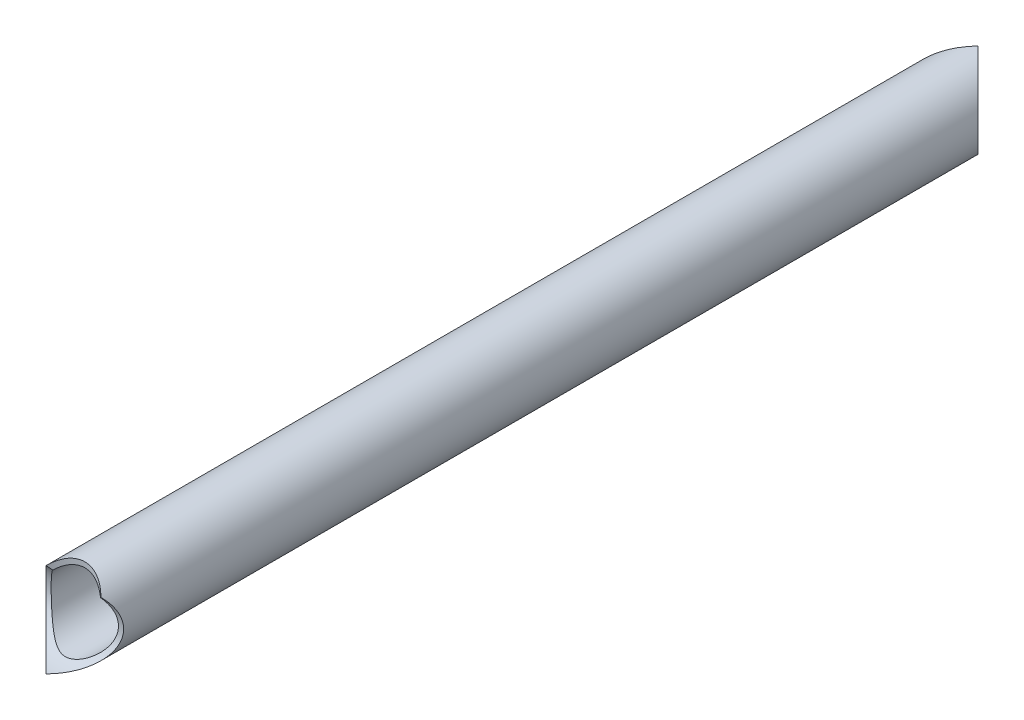
ISO-10303-21;
HEADER;
FILE_DESCRIPTION(('STEP AP214'),'2;1');
FILE_NAME('part.step','',(''),(''),'','','');
FILE_SCHEMA(('AUTOMOTIVE_DESIGN { 1 0 10303 214 1 1 1 1 }'));
ENDSEC;
DATA;
#1=APPLICATION_CONTEXT('core data for automotive mechanical design processes');
#2=APPLICATION_PROTOCOL_DEFINITION('international standard','automotive_design',2000,#1);
#3=PRODUCT_CONTEXT('',#1,'mechanical');
#4=PRODUCT('Part','Part','',(#3));
#5=PRODUCT_RELATED_PRODUCT_CATEGORY('part','',(#4));
#6=PRODUCT_DEFINITION_FORMATION('','',#4);
#7=PRODUCT_DEFINITION_CONTEXT('part definition',#1,'design');
#8=PRODUCT_DEFINITION('design','',#6,#7);
#9=PRODUCT_DEFINITION_SHAPE('','',#8);
#10=(LENGTH_UNIT() NAMED_UNIT(*) SI_UNIT(.MILLI.,.METRE.));
#11=(NAMED_UNIT(*) PLANE_ANGLE_UNIT() SI_UNIT($,.RADIAN.));
#12=(NAMED_UNIT(*) SI_UNIT($,.STERADIAN.) SOLID_ANGLE_UNIT());
#13=UNCERTAINTY_MEASURE_WITH_UNIT(LENGTH_MEASURE(1.E-05),#10,'distance_accuracy_value','');
#14=(GEOMETRIC_REPRESENTATION_CONTEXT(3) GLOBAL_UNCERTAINTY_ASSIGNED_CONTEXT((#13)) GLOBAL_UNIT_ASSIGNED_CONTEXT((#10,
#11,#12)) REPRESENTATION_CONTEXT('',''));
#15=CARTESIAN_POINT('',(0.,0.,0.));
#16=DIRECTION('',(0.,0.,1.));
#17=DIRECTION('',(1.,0.,0.));
#18=AXIS2_PLACEMENT_3D('',#15,#16,#17);
#19=CARTESIAN_POINT('',(-161.925,-228.6,0.));
#20=DIRECTION('',(1.,0.,0.));
#21=DIRECTION('',(0.,0.,-1.));
#22=AXIS2_PLACEMENT_3D('',#19,#20,#21);
#23=CYLINDRICAL_SURFACE('',#22,9.52499999999998);
#24=CARTESIAN_POINT('',(0.,-228.6,0.));
#25=DIRECTION('',(0.707106781186547,0.,-0.707106781186547));
#26=DIRECTION('',(-0.707106781186547,0.,-0.707106781186547));
#27=AXIS2_PLACEMENT_3D('',#24,#25,#26);
#28=ELLIPSE('',#27,13.4703841816037,9.52499999999999);
#29=CARTESIAN_POINT('',(0.,-219.075,0.));
#30=VERTEX_POINT('',#29);
#31=CARTESIAN_POINT('',(0.,-238.125,0.));
#32=VERTEX_POINT('',#31);
#33=EDGE_CURVE('E88',#30,#32,#28,.T.);
#34=ORIENTED_EDGE('',*,*,#33,.T.);
#35=CARTESIAN_POINT('',(0.,-228.6,0.));
#36=DIRECTION('',(-0.707106781186547,0.,-0.707106781186547));
#37=DIRECTION('',(0.707106781186547,0.,-0.707106781186547));
#38=AXIS2_PLACEMENT_3D('',#35,#36,#37);
#39=ELLIPSE('',#38,13.4703841816037,9.52499999999999);
#40=EDGE_CURVE('E85',#32,#30,#39,.T.);
#41=ORIENTED_EDGE('',*,*,#40,.T.);
#42=EDGE_LOOP('',(#34,#41));
#43=FACE_BOUND('',#42,.T.);
#44=CARTESIAN_POINT('',(8.255,-228.6,9.52499999999998));
#45=CARTESIAN_POINT('',(8.2549991309736,-228.793749133983,9.52499914862957));
#46=CARTESIAN_POINT('',(8.24816678082066,-228.987510695369,9.51907602387494));
#47=CARTESIAN_POINT('',(8.22096978778912,-229.373368577547,9.49551993069773));
#48=CARTESIAN_POINT('',(8.20060395213658,-229.565464750048,9.47788593013703));
#49=CARTESIAN_POINT('',(8.14671669800962,-229.946505754108,9.43129946891753));
#50=CARTESIAN_POINT('',(8.11318830370018,-230.135448859172,9.4023410066018));
#51=CARTESIAN_POINT('',(8.03357968300137,-230.508674190852,9.33373426055012));
#52=CARTESIAN_POINT('',(7.98749944772571,-230.692956414168,9.29408596924612));
#53=CARTESIAN_POINT('',(7.883876820132,-231.054517254249,9.20518387045815));
#54=CARTESIAN_POINT('',(7.82641012090953,-231.231833318214,9.15599353806628));
#55=CARTESIAN_POINT('',(7.70062697305924,-231.579870442183,9.04871137350904));
#56=CARTESIAN_POINT('',(7.6323057787879,-231.75058857676,8.99061564825053));
#57=CARTESIAN_POINT('',(7.48568628536983,-232.084651882336,8.86648613376938));
#58=CARTESIAN_POINT('',(7.40738906925855,-232.247997851083,8.80045320628405));
#59=CARTESIAN_POINT('',(7.24162523096907,-232.566887574014,8.66139148346517));
#60=CARTESIAN_POINT('',(7.15415660082003,-232.722429608553,8.58836115643807));
#61=CARTESIAN_POINT('',(6.93563606350435,-233.083524955091,8.40705776916898));
#62=CARTESIAN_POINT('',(6.80073731523925,-233.285372428281,8.29601262769738));
#63=CARTESIAN_POINT('',(6.51661799509542,-233.673118621409,8.064743848003));
#64=CARTESIAN_POINT('',(6.36739233738682,-233.859011633082,7.94451695352174));
#65=CARTESIAN_POINT('',(6.05568545559861,-234.215142976407,7.69694275303349));
#66=CARTESIAN_POINT('',(5.89317377902937,-234.385343327033,7.5695793122203));
#67=CARTESIAN_POINT('',(5.55624676339447,-234.709650125725,7.31032763517801));
#68=CARTESIAN_POINT('',(5.38183301047553,-234.863758711384,7.17844000303206));
#69=CARTESIAN_POINT('',(5.01788704155426,-235.159109417956,6.90973126096916));
#70=CARTESIAN_POINT('',(4.82811425764205,-235.300013389537,6.77286471020443));
#71=CARTESIAN_POINT('',(4.43682954916935,-235.565304618899,6.49972297017358));
#72=CARTESIAN_POINT('',(4.2353138496898,-235.689686522828,6.36344798637051));
#73=CARTESIAN_POINT('',(3.82063329870353,-235.921483300549,6.09531136489422));
#74=CARTESIAN_POINT('',(3.60749309828613,-236.028932333052,5.96344127621438));
#75=CARTESIAN_POINT('',(3.1684318197033,-236.226529850752,5.70855763052586));
#76=CARTESIAN_POINT('',(2.94252102945845,-236.316692012068,5.58553712092024));
#77=CARTESIAN_POINT('',(2.46681442998312,-236.482003581481,5.34987442057175));
#78=CARTESIAN_POINT('',(2.21641466916655,-236.556366663297,5.23788214298109));
#79=CARTESIAN_POINT('',(1.6996389172864,-236.682480743163,5.04111943195068));
#80=CARTESIAN_POINT('',(1.43329846759246,-236.734280059203,4.95629093434715));
#81=CARTESIAN_POINT('',(1.04394084534303,-236.789573262637,4.86390243338427));
#82=CARTESIAN_POINT('',(0.926240140688825,-236.803739392844,4.83991842714096));
#83=CARTESIAN_POINT('',(0.68899088744703,-236.827058784652,4.80017344286401));
#84=CARTESIAN_POINT('',(0.569443240153932,-236.836214416545,4.78440857680626));
#85=CARTESIAN_POINT('',(0.329320339337278,-236.849304199387,4.76180407323095));
#86=CARTESIAN_POINT('',(0.208746073071892,-236.853242897697,4.7549566628614));
#87=CARTESIAN_POINT('',(-0.0326338460710329,-236.855817780715,4.75048470187363));
#88=CARTESIAN_POINT('',(-0.153439501382275,-236.854453909342,4.75286024879902));
#89=CARTESIAN_POINT('',(-0.394165546022864,-236.846462088077,4.76671281142097));
#90=CARTESIAN_POINT('',(-0.514086996622046,-236.839842089721,4.77817607905766));
#91=CARTESIAN_POINT('',(-0.752426471254606,-236.821507905245,4.80965247391349));
#92=CARTESIAN_POINT('',(-0.870843834060238,-236.809791553356,4.82966923600077));
#93=CARTESIAN_POINT('',(-1.22310602414194,-236.767308180379,4.90141020066702));
#94=CARTESIAN_POINT('',(-1.45376292887394,-236.72921400914,4.96481146964588));
#95=CARTESIAN_POINT('',(-1.86370727584937,-236.644099327065,5.10130504482216));
#96=CARTESIAN_POINT('',(-2.04487996617531,-236.59983803945,5.17071608363488));
#97=CARTESIAN_POINT('',(-2.39953345699069,-236.500705639612,5.32095731682433));
#98=CARTESIAN_POINT('',(-2.57300885110593,-236.445827210796,5.40179537549808));
#99=CARTESIAN_POINT('',(-2.91302040075868,-236.32605718343,5.571759952105));
#100=CARTESIAN_POINT('',(-3.07953040069091,-236.261131514579,5.66091424590639));
#101=CARTESIAN_POINT('',(-3.40543837179348,-236.121927466596,5.84461572787491));
#102=CARTESIAN_POINT('',(-3.56483714546792,-236.047650146436,5.93916230476356));
#103=CARTESIAN_POINT('',(-3.95950975045322,-235.848366005193,6.18246639561214));
#104=CARTESIAN_POINT('',(-4.19036061822685,-235.717295478695,6.33346592764874));
#105=CARTESIAN_POINT('',(-4.63747538270596,-235.434385836415,6.63777489853464));
#106=CARTESIAN_POINT('',(-4.8537319131979,-235.282536348192,6.79108545677496));
#107=CARTESIAN_POINT('',(-5.27132385376008,-234.958297438884,7.09556835836753));
#108=CARTESIAN_POINT('',(-5.47267772045492,-234.785934138232,7.24674315239448));
#109=CARTESIAN_POINT('',(-5.85993838639321,-234.420393868889,7.54347617660768));
#110=CARTESIAN_POINT('',(-6.04585204532014,-234.227226231587,7.68903688542422));
#111=CARTESIAN_POINT('',(-6.3582089363936,-233.86880872899,7.93730120225216));
#112=CARTESIAN_POINT('',(-6.48822041734569,-233.707976401375,8.04190982332083));
#113=CARTESIAN_POINT('',(-6.73756594349468,-233.374263989522,8.24439807207292));
#114=CARTESIAN_POINT('',(-6.85690232909824,-233.201386560908,8.34227917360146));
#115=CARTESIAN_POINT('',(-7.08366003651119,-232.843997602673,8.5296406653929));
#116=CARTESIAN_POINT('',(-7.19109566852851,-232.659500473618,8.61913112474723));
#117=CARTESIAN_POINT('',(-7.39290924178347,-232.279162252312,8.78821213101052));
#118=CARTESIAN_POINT('',(-7.48728961825413,-232.083323285382,8.86780452395283));
#119=CARTESIAN_POINT('',(-7.6460745272022,-231.716896785423,9.00231134156524));
#120=CARTESIAN_POINT('',(-7.71282515872359,-231.548010254905,9.05909739341585));
#121=CARTESIAN_POINT('',(-7.83572387058534,-231.203811346086,9.16395879695114));
#122=CARTESIAN_POINT('',(-7.8918741654245,-231.028500319075,9.21203596790858));
#123=CARTESIAN_POINT('',(-7.99277926561639,-230.672375751217,9.29862621941024));
#124=CARTESIAN_POINT('',(-8.03753797954923,-230.491564121593,9.33714258026413));
#125=CARTESIAN_POINT('',(-8.11497986008864,-230.125491254042,9.40388814271988));
#126=CARTESIAN_POINT('',(-8.14766289484145,-229.940229967554,9.43211723199548));
#127=CARTESIAN_POINT('',(-8.20051181828126,-229.565693777288,9.47780652362298));
#128=CARTESIAN_POINT('',(-8.22061737363726,-229.376403964305,9.49521481683602));
#129=CARTESIAN_POINT('',(-8.24768993736896,-228.99618049332,9.51866289629087));
#130=CARTESIAN_POINT('',(-8.25465691616095,-228.805246831616,9.52470265693454));
#131=CARTESIAN_POINT('',(-8.2553183095402,-228.423354685229,9.52527587201023));
#132=CARTESIAN_POINT('',(-8.24901373573472,-228.232396203547,9.51981020342901));
#133=CARTESIAN_POINT('',(-8.22325492565545,-227.852047815249,9.49749861914187));
#134=CARTESIAN_POINT('',(-8.20380124943698,-227.662657842174,9.48065318813039));
#135=CARTESIAN_POINT('',(-8.15408122776019,-227.301276987326,9.43766380719512));
#136=CARTESIAN_POINT('',(-8.12475103759837,-227.129059372116,9.41232559052557));
#137=CARTESIAN_POINT('',(-8.05561104968292,-226.788261428203,9.35270884257684));
#138=CARTESIAN_POINT('',(-8.01579775061751,-226.619682335142,9.31842732431001));
#139=CARTESIAN_POINT('',(-7.92625943872893,-226.287193793368,9.24151845756409));
#140=CARTESIAN_POINT('',(-7.87653736329024,-226.123282977198,9.19889358247868));
#141=CARTESIAN_POINT('',(-7.76777500026873,-225.800772493091,9.10593936756861));
#142=CARTESIAN_POINT('',(-7.70873123855651,-225.642174832152,9.05560715548276));
#143=CARTESIAN_POINT('',(-7.57702515132393,-225.318760887249,8.94374675295488));
#144=CARTESIAN_POINT('',(-7.50365911320598,-225.154427355192,8.88165097638803));
#145=CARTESIAN_POINT('',(-7.34765599089065,-224.833184711284,8.75025080214965));
#146=CARTESIAN_POINT('',(-7.26501525757015,-224.676278556494,8.68094356792161));
#147=CARTESIAN_POINT('',(-7.00428589271634,-224.217216319907,8.4635302513619));
#148=CARTESIAN_POINT('',(-6.81336884998674,-223.926665178198,8.3059143565942));
#149=CARTESIAN_POINT('',(-6.45283278047182,-223.445068693598,8.01320461595647));
#150=CARTESIAN_POINT('',(-6.28928934942977,-223.24698711938,7.88192799380305));
#151=CARTESIAN_POINT('',(-5.94739409173004,-222.869526138686,7.61190373485768));
#152=CARTESIAN_POINT('',(-5.76904131931234,-222.690147928305,7.47315562111757));
#153=CARTESIAN_POINT('',(-5.3982783866759,-222.349627109202,7.19079436686113));
#154=CARTESIAN_POINT('',(-5.20583488153899,-222.188530218004,7.04717014783934));
#155=CARTESIAN_POINT('',(-4.8078844024781,-221.884949827782,6.75851614265832));
#156=CARTESIAN_POINT('',(-4.60238145150821,-221.742460637592,6.6134868009023));
#157=CARTESIAN_POINT('',(-4.22170022153728,-221.503388496548,6.35515925689206));
#158=CARTESIAN_POINT('',(-4.04894034477486,-221.403382572897,6.24145035992447));
#159=CARTESIAN_POINT('',(-3.69470620817147,-221.215258160118,6.01768753522882));
#160=CARTESIAN_POINT('',(-3.51323035552951,-221.127141855052,5.90763428181514));
#161=CARTESIAN_POINT('',(-3.14146809775944,-220.963421066369,5.69440913102353));
#162=CARTESIAN_POINT('',(-2.95120539019991,-220.887785187886,5.59122036896019));
#163=CARTESIAN_POINT('',(-2.56091153040393,-220.749545792574,5.39540026708191));
#164=CARTESIAN_POINT('',(-2.36088739974969,-220.686933073675,5.30276149380793));
#165=CARTESIAN_POINT('',(-1.9171010961857,-220.566906121685,5.11946097161139));
#166=CARTESIAN_POINT('',(-1.67147843973416,-220.511947549068,5.03151344556329));
#167=CARTESIAN_POINT('',(-1.29366079541495,-220.445995162006,4.92337591366429));
#168=CARTESIAN_POINT('',(-1.16625357807994,-220.426766608547,4.89130870864686));
#169=CARTESIAN_POINT('',(-0.908760812182196,-220.394148700816,4.83638807525039));
#170=CARTESIAN_POINT('',(-0.7786767431181,-220.380756207151,4.81352969366662));
#171=CARTESIAN_POINT('',(-0.515053294315988,-220.360010368661,4.77793189105998));
#172=CARTESIAN_POINT('',(-0.381491235325661,-220.35273047777,4.76531560533637));
#173=CARTESIAN_POINT('',(-0.11358208005872,-220.344693892553,4.75138012581384));
#174=CARTESIAN_POINT('',(0.0207649568470339,-220.34393671112,4.75006008842704));
#175=CARTESIAN_POINT('',(0.289034938598481,-220.348970145875,4.75879767507651));
#176=CARTESIAN_POINT('',(0.422957602740178,-220.354764441386,4.76886169242107));
#177=CARTESIAN_POINT('',(0.689111683742144,-220.372731137426,4.79979015185108));
#178=CARTESIAN_POINT('',(0.821342817729425,-220.384904590814,4.82065637679737));
#179=CARTESIAN_POINT('',(1.10454643006355,-220.417793404478,4.8763024194385));
#180=CARTESIAN_POINT('',(1.25505528789718,-220.439578635414,4.91279727603143));
#181=CARTESIAN_POINT('',(1.55170325268704,-220.490749992828,4.99680884433466));
#182=CARTESIAN_POINT('',(1.69783869586883,-220.520142303591,5.04433452044916));
#183=CARTESIAN_POINT('',(1.98570912314554,-220.586021121705,5.1483552274228));
#184=CARTESIAN_POINT('',(2.12742964309166,-220.622528578341,5.20487665227988));
#185=CARTESIAN_POINT('',(2.4059581107911,-220.702066057463,5.32479592263946));
#186=CARTESIAN_POINT('',(2.542767153659,-220.745094614622,5.38819222241237));
#187=CARTESIAN_POINT('',(2.90759118568054,-220.870168950102,5.56725013397185));
#188=CARTESIAN_POINT('',(3.13110425848443,-220.958163433105,5.68795470478581));
#189=CARTESIAN_POINT('',(3.56559758605923,-221.150968983281,5.93823193042161));
#190=CARTESIAN_POINT('',(3.77656911147845,-221.255791579878,6.06781063001076));
#191=CARTESIAN_POINT('',(4.18706965610037,-221.481824189893,6.3314612221958));
#192=CARTESIAN_POINT('',(4.38658228698,-221.603056880467,6.46553913594521));
#193=CARTESIAN_POINT('',(4.77419601105204,-221.861578509005,6.7345464325855));
#194=CARTESIAN_POINT('',(4.96229989336762,-221.998863498402,6.86947559839097));
#195=CARTESIAN_POINT('',(5.33822587447611,-222.298444095809,7.14562965260793));
#196=CARTESIAN_POINT('',(5.52532860119197,-222.461755311956,7.28673552413446));
#197=CARTESIAN_POINT('',(5.88601693765022,-222.806719513531,7.5638943285916));
#198=CARTESIAN_POINT('',(6.05959990411036,-222.988376069838,7.69994627070965));
#199=CARTESIAN_POINT('',(6.39160103031025,-223.369682424321,7.96385928877272));
#200=CARTESIAN_POINT('',(6.55005185964251,-223.569291566071,8.09173780370973));
#201=CARTESIAN_POINT('',(6.85042540907247,-223.98667872514,8.33674937621355));
#202=CARTESIAN_POINT('',(6.99235568599345,-224.204448356632,8.45388734147135));
#203=CARTESIAN_POINT('',(7.21895608703126,-224.591711433497,8.64240803344506));
#204=CARTESIAN_POINT('',(7.30828007272977,-224.756843154747,8.71719498210351));
#205=CARTESIAN_POINT('',(7.47660654907035,-225.095556720758,8.85879069211981));
#206=CARTESIAN_POINT('',(7.55561158090455,-225.269136470562,8.92560141738874));
#207=CARTESIAN_POINT('',(7.70228991439694,-225.623998853516,9.05010324269441));
#208=CARTESIAN_POINT('',(7.76997311226876,-225.805274584102,9.107802304579));
#209=CARTESIAN_POINT('',(7.89311833522139,-226.174795693031,9.2130828730719));
#210=CARTESIAN_POINT('',(7.94858170019485,-226.363040304597,9.26066548891849));
#211=CARTESIAN_POINT('',(8.039551741935,-226.718653766488,9.33887209356159));
#212=CARTESIAN_POINT('',(8.07676302214277,-226.885271665007,9.37093582182723));
#213=CARTESIAN_POINT('',(8.14097036810243,-227.221958753979,9.42633196678231));
#214=CARTESIAN_POINT('',(8.16796357789891,-227.392028895362,9.44966194236372));
#215=CARTESIAN_POINT('',(8.21131805296772,-227.734511854833,9.48716109489849));
#216=CARTESIAN_POINT('',(8.22768016098987,-227.906924486121,9.50133099798964));
#217=CARTESIAN_POINT('',(8.24951956226246,-228.252888376113,9.52024913405288));
#218=CARTESIAN_POINT('',(8.2550007784753,-228.426439201805,9.52500076265902));
#219=CARTESIAN_POINT('',(8.255,-228.6,9.52499999999998));
#220=B_SPLINE_CURVE_WITH_KNOTS('',3,(#44,#45,#46,#47,#48,#49,#50,#51,#52,#53,#54,#55,#56,#57,
#58,#59,#60,#61,#62,#63,#64,#65,#66,#67,#68,#69,#70,#71,#72,#73,#74,#75,#76,#77,#78,#79,#80,#81,
#82,#83,#84,#85,#86,#87,#88,#89,#90,#91,#92,#93,#94,#95,#96,#97,#98,#99,#100,#101,#102,#103,
#104,#105,#106,#107,#108,#109,#110,#111,#112,#113,#114,#115,#116,#117,#118,#119,#120,#121,#122,
#123,#124,#125,#126,#127,#128,#129,#130,#131,#132,#133,#134,#135,#136,#137,#138,#139,#140,#141,
#142,#143,#144,#145,#146,#147,#148,#149,#150,#151,#152,#153,#154,#155,#156,#157,#158,#159,#160,
#161,#162,#163,#164,#165,#166,#167,#168,#169,#170,#171,#172,#173,#174,#175,#176,#177,#178,#179,
#180,#181,#182,#183,#184,#185,#186,#187,#188,#189,#190,#191,#192,#193,#194,#195,#196,#197,#198,
#199,#200,#201,#202,#203,#204,#205,#206,#207,#208,#209,#210,#211,#212,#213,#214,#215,#216,#217,
#218,#219),.UNSPECIFIED.,.T.,.F.,(4,2,2,2,2,2,2,2,2,2,2,2,2,2,2,2,2,2,2,2,2,2,2,2,2,2,2,2,2,2,2,
2,2,2,2,2,2,2,2,2,2,2,2,2,2,2,2,2,2,2,2,2,2,2,2,2,2,2,2,2,2,2,2,2,2,2,2,2,2,2,2,2,2,2,2,2,2,2,2,
2,2,2,2,2,2,2,2,4),(0.,0.581060302241148,1.16217182303355,1.74359173542285,2.3250120594397,
2.90268969124201,3.48062058537875,4.05848879048121,4.63648377810276,5.43621695420251,
6.23623508026262,7.03814127970887,7.83994081992868,8.65857780584581,9.47747942119572,
10.2947073130676,11.1112859813718,11.9620431912298,12.8109695269324,13.1734956172864,
13.5358500604877,13.8978884475344,14.2599306635729,14.6214262186982,14.9830755469358,
15.7069631447091,16.3031815010826,16.8998122025499,17.4985123074859,18.0971446771323,
19.0121600805803,19.927633918925,20.8419543021521,21.7558662790184,22.4505614625091,
23.1451039659047,23.8388020282264,24.5323705181271,25.102627506706,25.6727652316906,
26.2427070714556,26.8126551342036,27.3853166471829,27.9579794496038,28.5305986031097,
29.1031933687764,29.6321866176357,30.1613567724987,30.6903702914557,31.2195814376324,
31.7901536941553,32.360951234249,33.5023725912857,34.3667872613036,35.2312571774337,
36.097843397763,36.9641639487798,37.6529096955542,38.341781789667,39.0288936791848,
39.715518398605,40.512573766315,40.9105237639805,41.3082594272077,41.7107088469782,
42.1131282121322,42.5157736890733,42.918485642225,43.38692566356,43.8557477127695,
44.32597156752,44.7960899166667,45.6013224389748,46.4071090223581,47.2140207141776,
48.0207343366109,48.8767355197429,49.732903643882,50.5871794481831,51.441062941544,
52.0468024868874,52.6523925776822,53.2574505352097,53.8624421156741,54.3830405578493,
54.9037844002805,55.4244869572119,55.9450017475653),.UNSPECIFIED.);
#221=CARTESIAN_POINT('',(8.255,-228.6,9.52499999999998));
#222=VERTEX_POINT('',#221);
#223=EDGE_CURVE('E82',#222,#222,#220,.T.);
#224=ORIENTED_EDGE('',*,*,#223,.F.);
#225=EDGE_LOOP('',(#224));
#226=FACE_BOUND('',#225,.T.);
#227=ADVANCED_FACE('F33',(#43,#226),#23,.F.);
#228=CARTESIAN_POINT('',(0.,-219.075,228.6));
#229=DIRECTION('',(0.,-1.,0.));
#230=DIRECTION('',(0.,0.,-1.));
#231=AXIS2_PLACEMENT_3D('',#228,#229,#230);
#232=CYLINDRICAL_SURFACE('',#231,9.52499999999999);
#233=CARTESIAN_POINT('',(0.,-228.6,228.6));
#234=DIRECTION('',(0.707106781186547,-0.707106781186547,0.));
#235=DIRECTION('',(-0.707106781186547,-0.707106781186547,0.));
#236=AXIS2_PLACEMENT_3D('',#233,#234,#235);
#237=ELLIPSE('',#236,13.4703841816037,9.52499999999999);
#238=CARTESIAN_POINT('',(6.73519209080185,-221.864807909198,221.864807909198));
#239=VERTEX_POINT('',#238);
#240=CARTESIAN_POINT('',(5.837166478695,-222.762833521305,221.073173809633));
#241=VERTEX_POINT('',#240);
#242=EDGE_CURVE('E47',#239,#241,#237,.F.);
#243=ORIENTED_EDGE('',*,*,#242,.F.);
#244=CARTESIAN_POINT('',(0.,-228.6,228.6));
#245=DIRECTION('',(0.,-0.707106781186547,-0.707106781186548));
#246=DIRECTION('',(0.,0.707106781186548,-0.707106781186547));
#247=AXIS2_PLACEMENT_3D('',#244,#245,#246);
#248=ELLIPSE('',#247,13.4703841816037,9.525);
#249=CARTESIAN_POINT('',(-6.73519209080185,-221.864807909198,221.864807909198));
#250=VERTEX_POINT('',#249);
#251=EDGE_CURVE('E84',#250,#239,#248,.T.);
#252=ORIENTED_EDGE('',*,*,#251,.F.);
#253=CARTESIAN_POINT('',(0.,-228.6,228.6));
#254=DIRECTION('',(-0.707106781186547,-0.707106781186547,0.));
#255=DIRECTION('',(0.707106781186547,-0.707106781186547,0.));
#256=AXIS2_PLACEMENT_3D('',#253,#254,#255);
#257=ELLIPSE('',#256,13.4703841816037,9.52499999999999);
#258=CARTESIAN_POINT('',(-5.83716647869502,-222.762833521305,221.073173809633));
#259=VERTEX_POINT('',#258);
#260=EDGE_CURVE('E11',#259,#250,#257,.F.);
#261=ORIENTED_EDGE('',*,*,#260,.F.);
#262=CARTESIAN_POINT('',(0.,-220.345,219.075));
#263=CARTESIAN_POINT('',(0.193749133982708,-220.345000869026,219.07500085137));
#264=CARTESIAN_POINT('',(0.387510695368548,-220.351833219179,219.080923976125));
#265=CARTESIAN_POINT('',(0.773368577546698,-220.379030212211,219.104480069302));
#266=CARTESIAN_POINT('',(0.965464750048039,-220.399396047863,219.122114069863));
#267=CARTESIAN_POINT('',(1.34650575410772,-220.45328330199,219.168700531082));
#268=CARTESIAN_POINT('',(1.53544885917174,-220.4868116963,219.197658993398));
#269=CARTESIAN_POINT('',(1.90867419085192,-220.566420316999,219.26626573945));
#270=CARTESIAN_POINT('',(2.09295641416823,-220.612500552274,219.305914030754));
#271=CARTESIAN_POINT('',(2.45451725424898,-220.716123179868,219.394816129542));
#272=CARTESIAN_POINT('',(2.63183331821417,-220.773589879091,219.444006461934));
#273=CARTESIAN_POINT('',(2.97987044218349,-220.899373026941,219.551288626491));
#274=CARTESIAN_POINT('',(3.15058857675983,-220.967694221212,219.609384351749));
#275=CARTESIAN_POINT('',(3.48465188233568,-221.11431371463,219.733513866231));
#276=CARTESIAN_POINT('',(3.64799785108297,-221.192610930741,219.799546793716));
#277=CARTESIAN_POINT('',(3.9668875740142,-221.358374769031,219.938608516535));
#278=CARTESIAN_POINT('',(4.12242960855343,-221.44584339918,220.011638843562));
#279=CARTESIAN_POINT('',(4.48352495509109,-221.664363936496,220.192942230831));
#280=CARTESIAN_POINT('',(4.68537242828056,-221.799262684761,220.303987372303));
#281=CARTESIAN_POINT('',(5.07311862140913,-222.083382004905,220.535256151997));
#282=CARTESIAN_POINT('',(5.25901163308176,-222.232607662613,220.655483046478));
#283=CARTESIAN_POINT('',(5.61514297640732,-222.544314544401,220.903057246966));
#284=CARTESIAN_POINT('',(5.78534332703317,-222.706826220971,221.03042068778));
#285=CARTESIAN_POINT('',(6.1096501257253,-223.043753236606,221.289672364822));
#286=CARTESIAN_POINT('',(6.26375871138407,-223.218166989525,221.421559996968));
#287=CARTESIAN_POINT('',(6.55910941795629,-223.582112958446,221.690268739031));
#288=CARTESIAN_POINT('',(6.70001338953653,-223.771885742358,221.827135289795));
#289=CARTESIAN_POINT('',(6.96530461889882,-224.163170450831,222.100277029826));
#290=CARTESIAN_POINT('',(7.08968652282802,-224.36468615031,222.236552013629));
#291=CARTESIAN_POINT('',(7.32148330054927,-224.779366701297,222.504688635106));
#292=CARTESIAN_POINT('',(7.42893233305184,-224.992506901714,222.636558723786));
#293=CARTESIAN_POINT('',(7.62652985075221,-225.431568180297,222.891442369474));
#294=CARTESIAN_POINT('',(7.71669201206843,-225.657478970542,223.01446287908));
#295=CARTESIAN_POINT('',(7.88200358148074,-226.133185570017,223.250125579428));
#296=CARTESIAN_POINT('',(7.95636666329744,-226.383585330833,223.362117857019));
#297=CARTESIAN_POINT('',(8.08248074316303,-226.900361082714,223.558880568049));
#298=CARTESIAN_POINT('',(8.1342800592027,-227.166701532408,223.643709065653));
#299=CARTESIAN_POINT('',(8.18957326263654,-227.556059154657,223.736097566616));
#300=CARTESIAN_POINT('',(8.20373939284397,-227.673759859311,223.760081572859));
#301=CARTESIAN_POINT('',(8.22705878465155,-227.911009112553,223.799826557136));
#302=CARTESIAN_POINT('',(8.23621441654546,-228.030556759846,223.815591423194));
#303=CARTESIAN_POINT('',(8.2493041993867,-228.270679660663,223.838195926769));
#304=CARTESIAN_POINT('',(8.25324289769712,-228.391253926928,223.845043337138));
#305=CARTESIAN_POINT('',(8.25581778071506,-228.632633846071,223.849515298126));
#306=CARTESIAN_POINT('',(8.25445390934166,-228.753439501382,223.847139751201));
#307=CARTESIAN_POINT('',(8.24646208807654,-228.994165546023,223.833287188579));
#308=CARTESIAN_POINT('',(8.2398420897209,-229.114086996622,223.821823920942));
#309=CARTESIAN_POINT('',(8.22150790524539,-229.352426471255,223.790347526086));
#310=CARTESIAN_POINT('',(8.20979155335593,-229.47084383406,223.770330763999));
#311=CARTESIAN_POINT('',(8.16730818037862,-229.823106024142,223.698589799333));
#312=CARTESIAN_POINT('',(8.12921400914041,-230.053762928874,223.635188530354));
#313=CARTESIAN_POINT('',(8.04409932706535,-230.463707275849,223.498694955178));
#314=CARTESIAN_POINT('',(7.99983803945024,-230.644879966175,223.429283916365));
#315=CARTESIAN_POINT('',(7.90070563961175,-230.999533456991,223.279042683176));
#316=CARTESIAN_POINT('',(7.84582721079585,-231.173008851106,223.198204624502));
#317=CARTESIAN_POINT('',(7.72605718342993,-231.513020400759,223.028240047895));
#318=CARTESIAN_POINT('',(7.66113151457856,-231.679530400691,222.939085754094));
#319=CARTESIAN_POINT('',(7.52192746659583,-232.005438371794,222.755384272125));
#320=CARTESIAN_POINT('',(7.44765014643552,-232.164837145468,222.660837695236));
#321=CARTESIAN_POINT('',(7.24836600519316,-232.559509750453,222.417533604388));
#322=CARTESIAN_POINT('',(7.11729547869541,-232.790360618227,222.266534072351));
#323=CARTESIAN_POINT('',(6.83438583641456,-233.237475382706,221.962225101465));
#324=CARTESIAN_POINT('',(6.68253634819235,-233.453731913198,221.808914543225));
#325=CARTESIAN_POINT('',(6.35829743888427,-233.87132385376,221.504431641632));
#326=CARTESIAN_POINT('',(6.18593413823202,-234.072677720455,221.353256847605));
#327=CARTESIAN_POINT('',(5.82039386888942,-234.459938386393,221.056523823392));
#328=CARTESIAN_POINT('',(5.62722623158674,-234.64585204532,220.910963114576));
#329=CARTESIAN_POINT('',(5.26880872898991,-234.958208936394,220.662698797748));
#330=CARTESIAN_POINT('',(5.10797640137497,-235.088220417346,220.558090176679));
#331=CARTESIAN_POINT('',(4.77426398952177,-235.337565943495,220.355601927927));
#332=CARTESIAN_POINT('',(4.60138656090798,-235.456902329098,220.257720826398));
#333=CARTESIAN_POINT('',(4.24399760267341,-235.683660036511,220.070359334607));
#334=CARTESIAN_POINT('',(4.05950047361767,-235.791095668529,219.980868875253));
#335=CARTESIAN_POINT('',(3.67916225231211,-235.992909241784,219.811787868989));
#336=CARTESIAN_POINT('',(3.48332328538176,-236.087289618254,219.732195476047));
#337=CARTESIAN_POINT('',(3.11689678542335,-236.246074527202,219.597688658435));
#338=CARTESIAN_POINT('',(2.94801025490547,-236.312825158724,219.540902606584));
#339=CARTESIAN_POINT('',(2.60381134608641,-236.435723870585,219.436041203049));
#340=CARTESIAN_POINT('',(2.42850031907459,-236.491874165425,219.387964032091));
#341=CARTESIAN_POINT('',(2.0723757512167,-236.592779265616,219.30137378059));
#342=CARTESIAN_POINT('',(1.89156412159269,-236.637537979549,219.262857419736));
#343=CARTESIAN_POINT('',(1.52549125404211,-236.714979860089,219.19611185728));
#344=CARTESIAN_POINT('',(1.34022996755348,-236.747662894841,219.167882768004));
#345=CARTESIAN_POINT('',(0.965693777288019,-236.800511818281,219.122193476377));
#346=CARTESIAN_POINT('',(0.776403964305411,-236.820617373637,219.104785183164));
#347=CARTESIAN_POINT('',(0.396180493319812,-236.847689937369,219.081337103709));
#348=CARTESIAN_POINT('',(0.205246831616394,-236.854656916161,219.075297343065));
#349=CARTESIAN_POINT('',(-0.176645314770568,-236.85531830954,219.07472412799));
#350=CARTESIAN_POINT('',(-0.367603796452825,-236.849013735735,219.080189796571));
#351=CARTESIAN_POINT('',(-0.747952184751143,-236.823254925655,219.102501380858));
#352=CARTESIAN_POINT('',(-0.937342157826406,-236.803801249437,219.11934681187));
#353=CARTESIAN_POINT('',(-1.29872301267435,-236.75408122776,219.162336192805));
#354=CARTESIAN_POINT('',(-1.47094062788416,-236.724751037598,219.187674409474));
#355=CARTESIAN_POINT('',(-1.81173857179723,-236.655611049683,219.247291157423));
#356=CARTESIAN_POINT('',(-1.98031766485832,-236.615797750618,219.28157267569));
#357=CARTESIAN_POINT('',(-2.31280620663191,-236.526259438729,219.358481542436));
#358=CARTESIAN_POINT('',(-2.47671702280222,-236.47653736329,219.401106417521));
#359=CARTESIAN_POINT('',(-2.79922750690905,-236.367775000269,219.494060632431));
#360=CARTESIAN_POINT('',(-2.95782516784805,-236.308731238557,219.544392844517));
#361=CARTESIAN_POINT('',(-3.28123911275146,-236.177025151324,219.656253247045));
#362=CARTESIAN_POINT('',(-3.4455726448075,-236.103659113206,219.718349023612));
#363=CARTESIAN_POINT('',(-3.76681528871589,-235.947655990891,219.84974919785));
#364=CARTESIAN_POINT('',(-3.92372144350641,-235.86501525757,219.919056432078));
#365=CARTESIAN_POINT('',(-4.38278368009278,-235.604285892716,220.136469748638));
#366=CARTESIAN_POINT('',(-4.67333482180182,-235.413368849987,220.294085643406));
#367=CARTESIAN_POINT('',(-5.1549313064018,-235.052832780472,220.586795384043));
#368=CARTESIAN_POINT('',(-5.35301288062008,-234.88928934943,220.718072006197));
#369=CARTESIAN_POINT('',(-5.73047386131385,-234.54739409173,220.988096265142));
#370=CARTESIAN_POINT('',(-5.90985207169504,-234.369041319312,221.126844378882));
#371=CARTESIAN_POINT('',(-6.25037289079781,-233.998278386676,221.409205633139));
#372=CARTESIAN_POINT('',(-6.41146978199638,-233.805834881539,221.552829852161));
#373=CARTESIAN_POINT('',(-6.7150501722183,-233.407884402478,221.841483857342));
#374=CARTESIAN_POINT('',(-6.85753936240803,-233.202381451508,221.986513199098));
#375=CARTESIAN_POINT('',(-7.09661150345158,-232.821700221537,222.244840743108));
#376=CARTESIAN_POINT('',(-7.19661742710287,-232.648940344775,222.358549640075));
#377=CARTESIAN_POINT('',(-7.38474183988216,-232.294706208171,222.582312464771));
#378=CARTESIAN_POINT('',(-7.47285814494784,-232.11323035553,222.692365718185));
#379=CARTESIAN_POINT('',(-7.63657893363065,-231.741468097759,222.905590868976));
#380=CARTESIAN_POINT('',(-7.71221481211429,-231.5512053902,223.00877963104));
#381=CARTESIAN_POINT('',(-7.8504542074264,-231.160911530404,223.204599732918));
#382=CARTESIAN_POINT('',(-7.9130669263247,-230.96088739975,223.297238506192));
#383=CARTESIAN_POINT('',(-8.03309387831453,-230.517101096186,223.480539028389));
#384=CARTESIAN_POINT('',(-8.08805245093232,-230.271478439734,223.568486554437));
#385=CARTESIAN_POINT('',(-8.15400483799359,-229.893660795415,223.676624086336));
#386=CARTESIAN_POINT('',(-8.17323339145289,-229.76625357808,223.708691291353));
#387=CARTESIAN_POINT('',(-8.20585129918378,-229.508760812182,223.76361192475));
#388=CARTESIAN_POINT('',(-8.21924379284914,-229.378676743118,223.786470306333));
#389=CARTESIAN_POINT('',(-8.23998963133893,-229.115053294316,223.82206810894));
#390=CARTESIAN_POINT('',(-8.24726952222987,-228.981491235326,223.834684394664));
#391=CARTESIAN_POINT('',(-8.25530610744689,-228.713582080059,223.848619874186));
#392=CARTESIAN_POINT('',(-8.25606328887974,-228.579235043153,223.849939911573));
#393=CARTESIAN_POINT('',(-8.25102985412451,-228.310965061402,223.841202324923));
#394=CARTESIAN_POINT('',(-8.24523555861444,-228.17704239726,223.831138307579));
#395=CARTESIAN_POINT('',(-8.2272688625743,-227.910888316258,223.800209848149));
#396=CARTESIAN_POINT('',(-8.21509540918585,-227.778657182271,223.779343623203));
#397=CARTESIAN_POINT('',(-8.18220659552174,-227.495453569936,223.723697580561));
#398=CARTESIAN_POINT('',(-8.16042136458583,-227.344944712103,223.687202723968));
#399=CARTESIAN_POINT('',(-8.10925000717226,-227.048296747313,223.603191155665));
#400=CARTESIAN_POINT('',(-8.07985769640949,-226.902161304131,223.555665479551));
#401=CARTESIAN_POINT('',(-8.01397887829545,-226.614290876854,223.451644772577));
#402=CARTESIAN_POINT('',(-7.97747142165907,-226.472570356908,223.39512334772));
#403=CARTESIAN_POINT('',(-7.8979339425372,-226.194041889209,223.27520407736));
#404=CARTESIAN_POINT('',(-7.8549053853782,-226.057232846341,223.211807777587));
#405=CARTESIAN_POINT('',(-7.72983104989829,-225.692408814319,223.032749866028));
#406=CARTESIAN_POINT('',(-7.64183656689504,-225.468895741516,222.912045295214));
#407=CARTESIAN_POINT('',(-7.4490310167194,-225.034402413941,222.661768069578));
#408=CARTESIAN_POINT('',(-7.34420842012193,-224.823430888522,222.532189369989));
#409=CARTESIAN_POINT('',(-7.11817581010648,-224.4129303439,222.268538777804));
#410=CARTESIAN_POINT('',(-6.99694311953327,-224.21341771302,222.134460864055));
#411=CARTESIAN_POINT('',(-6.73842149099524,-223.825803988948,221.865453567414));
#412=CARTESIAN_POINT('',(-6.60113650159798,-223.637700106632,221.730524401609));
#413=CARTESIAN_POINT('',(-6.30155590419081,-223.261774125524,221.454370347392));
#414=CARTESIAN_POINT('',(-6.13824468804442,-223.074671398808,221.313264475865));
#415=CARTESIAN_POINT('',(-5.79328048646943,-222.71398306235,221.036105671408));
#416=CARTESIAN_POINT('',(-5.61162393016209,-222.54040009589,220.90005372929));
#417=CARTESIAN_POINT('',(-5.23031757567867,-222.20839896969,220.636140711227));
#418=CARTESIAN_POINT('',(-5.03070843392945,-222.049948140358,220.50826219629));
#419=CARTESIAN_POINT('',(-4.61332127485986,-221.749574590928,220.263250623786));
#420=CARTESIAN_POINT('',(-4.39555164336823,-221.607644314007,220.146112658529));
#421=CARTESIAN_POINT('',(-4.00828856650278,-221.381043912969,219.957591966555));
#422=CARTESIAN_POINT('',(-3.84315684525286,-221.29171992727,219.882805017896));
#423=CARTESIAN_POINT('',(-3.50444327924167,-221.12339345093,219.74120930788));
#424=CARTESIAN_POINT('',(-3.33086352943793,-221.044388419095,219.674398582611));
#425=CARTESIAN_POINT('',(-2.97600114648418,-220.897710085603,219.549896757306));
#426=CARTESIAN_POINT('',(-2.79472541589764,-220.830026887731,219.492197695421));
#427=CARTESIAN_POINT('',(-2.42520430696857,-220.706881664779,219.386917126928));
#428=CARTESIAN_POINT('',(-2.23695969540343,-220.651418299805,219.339334511081));
#429=CARTESIAN_POINT('',(-1.88134623351221,-220.560448258065,219.261127906438));
#430=CARTESIAN_POINT('',(-1.71472833499286,-220.523236977857,219.229064178173));
#431=CARTESIAN_POINT('',(-1.37804124602052,-220.459029631898,219.173668033218));
#432=CARTESIAN_POINT('',(-1.20797110463795,-220.432036422101,219.150338057636));
#433=CARTESIAN_POINT('',(-0.865488145166974,-220.388681947032,219.112838905101));
#434=CARTESIAN_POINT('',(-0.693075513879146,-220.37231983901,219.09866900201));
#435=CARTESIAN_POINT('',(-0.347111623887307,-220.350480437738,219.079750865947));
#436=CARTESIAN_POINT('',(-0.173560798194561,-220.344999221525,219.074999237341));
#437=CARTESIAN_POINT('',(0.,-220.345,219.075));
#438=B_SPLINE_CURVE_WITH_KNOTS('',3,(#262,#263,#264,#265,#266,#267,#268,#269,#270,#271,#272,
#273,#274,#275,#276,#277,#278,#279,#280,#281,#282,#283,#284,#285,#286,#287,#288,#289,#290,#291,
#292,#293,#294,#295,#296,#297,#298,#299,#300,#301,#302,#303,#304,#305,#306,#307,#308,#309,#310,
#311,#312,#313,#314,#315,#316,#317,#318,#319,#320,#321,#322,#323,#324,#325,#326,#327,#328,#329,
#330,#331,#332,#333,#334,#335,#336,#337,#338,#339,#340,#341,#342,#343,#344,#345,#346,#347,#348,
#349,#350,#351,#352,#353,#354,#355,#356,#357,#358,#359,#360,#361,#362,#363,#364,#365,#366,#367,
#368,#369,#370,#371,#372,#373,#374,#375,#376,#377,#378,#379,#380,#381,#382,#383,#384,#385,#386,
#387,#388,#389,#390,#391,#392,#393,#394,#395,#396,#397,#398,#399,#400,#401,#402,#403,#404,#405,
#406,#407,#408,#409,#410,#411,#412,#413,#414,#415,#416,#417,#418,#419,#420,#421,#422,#423,#424,
#425,#426,#427,#428,#429,#430,#431,#432,#433,#434,#435,#436,#437),.UNSPECIFIED.,.T.,.F.,(4,2,2,
2,2,2,2,2,2,2,2,2,2,2,2,2,2,2,2,2,2,2,2,2,2,2,2,2,2,2,2,2,2,2,2,2,2,2,2,2,2,2,2,2,2,2,2,2,2,2,2,
2,2,2,2,2,2,2,2,2,2,2,2,2,2,2,2,2,2,2,2,2,2,2,2,2,2,2,2,2,2,2,2,2,2,2,2,4),(0.,
0.581060302241168,1.16217182303357,1.74359173542286,2.32501205943971,2.90268969124202,
3.48062058537873,4.05848879048122,4.63648377810278,5.43621695420252,6.23623508026263,
7.03814127970889,7.8399408199287,8.65857780584584,9.47747942119576,10.2947073130676,
11.1112859813718,11.9620431912297,12.8109695269324,13.1734956172863,13.5358500604876,
13.8978884475343,14.2599306635728,14.6214262186981,14.9830755469357,15.706963144709,
16.3031815010825,16.8998122025499,17.4985123074859,18.0971446771323,19.0121600805803,
19.9276339189251,20.8419543021521,21.7558662790184,22.4505614625091,23.1451039659047,
23.8388020282264,24.5323705181272,25.102627506706,25.6727652316906,26.2427070714557,
26.8126551342036,27.3853166471829,27.9579794496038,28.5305986031097,29.1031933687764,
29.6321866176357,30.1613567724987,30.6903702914557,31.2195814376324,31.7901536941553,
32.360951234249,33.5023725912857,34.3667872613036,35.2312571774338,36.097843397763,
36.9641639487798,37.6529096955542,38.3417817896671,39.0288936791849,39.715518398605,
40.512573766315,40.9105237639805,41.3082594272077,41.7107088469781,42.1131282121322,
42.5157736890733,42.918485642225,43.38692566356,43.8557477127695,44.32597156752,
44.7960899166667,45.6013224389748,46.4071090223582,47.2140207141777,48.020734336611,
48.8767355197429,49.732903643882,50.5871794481831,51.4410629415441,52.0468024868875,
52.6523925776822,53.2574505352097,53.8624421156741,54.3830405578493,54.9037844002805,
55.4244869572119,55.9450017475653),.UNSPECIFIED.);
#439=EDGE_CURVE('E80',#259,#241,#438,.T.);
#440=ORIENTED_EDGE('',*,*,#439,.T.);
#441=EDGE_LOOP('',(#243,#252,#261,#440));
#442=FACE_BOUND('',#441,.T.);
#443=ADVANCED_FACE('F83',(#442),#232,.F.);
#444=CARTESIAN_POINT('',(0.,-228.6,228.6));
#445=DIRECTION('',(0.,0.,-1.));
#446=DIRECTION('',(0.,1.,0.));
#447=AXIS2_PLACEMENT_3D('',#444,#445,#446);
#448=CYLINDRICAL_SURFACE('',#447,9.525);
#449=CARTESIAN_POINT('',(0.,-228.6,228.6));
#450=DIRECTION('',(0.707106781186547,0.,-0.707106781186547));
#451=DIRECTION('',(-0.707106781186547,0.,-0.707106781186547));
#452=AXIS2_PLACEMENT_3D('',#449,#450,#451);
#453=ELLIPSE('',#452,13.4703841816037,9.525);
#454=CARTESIAN_POINT('',(0.,-238.125,228.6));
#455=VERTEX_POINT('',#454);
#456=EDGE_CURVE('E81',#250,#455,#453,.F.);
#457=ORIENTED_EDGE('',*,*,#456,.F.);
#458=ORIENTED_EDGE('',*,*,#251,.T.);
#459=CARTESIAN_POINT('',(0.,-228.6,228.6));
#460=DIRECTION('',(-0.707106781186547,0.,-0.707106781186547));
#461=DIRECTION('',(0.707106781186547,0.,-0.707106781186547));
#462=AXIS2_PLACEMENT_3D('',#459,#460,#461);
#463=ELLIPSE('',#462,13.4703841816037,9.525);
#464=EDGE_CURVE('E71',#455,#239,#463,.F.);
#465=ORIENTED_EDGE('',*,*,#464,.F.);
#466=EDGE_LOOP('',(#457,#458,#465));
#467=FACE_BOUND('',#466,.T.);
#468=ORIENTED_EDGE('',*,*,#33,.F.);
#469=ORIENTED_EDGE('',*,*,#40,.F.);
#470=EDGE_LOOP('',(#468,#469));
#471=FACE_BOUND('',#470,.T.);
#472=ADVANCED_FACE('F103',(#467,#471),#448,.T.);
#473=CARTESIAN_POINT('',(0.,-228.6,228.6));
#474=DIRECTION('',(0.,0.,-1.));
#475=DIRECTION('',(0.,1.,0.));
#476=AXIS2_PLACEMENT_3D('',#473,#474,#475);
#477=CYLINDRICAL_SURFACE('',#476,8.255);
#478=ORIENTED_EDGE('',*,*,#223,.T.);
#479=EDGE_LOOP('',(#478));
#480=FACE_BOUND('',#479,.T.);
#481=ORIENTED_EDGE('',*,*,#439,.F.);
#482=CARTESIAN_POINT('',(0.,-220.345,223.848095118797));
#483=CARTESIAN_POINT('',(-0.135655546148849,-220.344996321841,223.848105333112));
#484=CARTESIAN_POINT('',(-0.271277656091385,-220.348351012075,223.842260499928));
#485=CARTESIAN_POINT('',(-0.541272953064596,-220.361656219574,223.819257519012));
#486=CARTESIAN_POINT('',(-0.675645742214575,-220.371608769751,223.802095884391));
#487=CARTESIAN_POINT('',(-0.942295424086365,-220.397859694978,223.757357791509));
#488=CARTESIAN_POINT('',(-1.07456695404325,-220.414172220086,223.72975811419));
#489=CARTESIAN_POINT('',(-1.33601736063069,-220.452757545791,223.665481983676));
#490=CARTESIAN_POINT('',(-1.46519489061247,-220.475032892102,223.628801654171));
#491=CARTESIAN_POINT('',(-1.77500336273896,-220.535947517145,223.530353919286));
#492=CARTESIAN_POINT('',(-1.95379062427453,-220.577500622833,223.464590374509));
#493=CARTESIAN_POINT('',(-2.30385769496949,-220.670931089417,223.321478130963));
#494=CARTESIAN_POINT('',(-2.47513319304754,-220.722814286644,223.244122889214));
#495=CARTESIAN_POINT('',(-2.81092641284362,-220.836288228685,223.080913848368));
#496=CARTESIAN_POINT('',(-2.97542141871818,-220.897908713207,222.995034323331));
#497=CARTESIAN_POINT('',(-3.29749611909182,-221.030201895937,222.817608896567));
#498=CARTESIAN_POINT('',(-3.45507632677546,-221.100873920851,222.726063416561));
#499=CARTESIAN_POINT('',(-3.84973065266654,-221.292739997934,222.487368178982));
#500=CARTESIAN_POINT('',(-4.08223351978583,-221.420160561037,222.337629545601));
#501=CARTESIAN_POINT('',(-4.53266062865202,-221.695674614923,222.035102572798));
#502=CARTESIAN_POINT('',(-4.75057725789492,-221.84377877786,221.882312694121));
#503=CARTESIAN_POINT('',(-5.17166746250181,-222.160420381687,221.57820623111));
#504=CARTESIAN_POINT('',(-5.37485644128694,-222.328935966915,221.426888255098));
#505=CARTESIAN_POINT('',(-5.76604719603185,-222.686632729974,221.129268880716));
#506=CARTESIAN_POINT('',(-5.95405552024644,-222.875804913741,220.98296533519));
#507=CARTESIAN_POINT('',(-6.27277775679104,-223.229675234222,220.731001954068));
#508=CARTESIAN_POINT('',(-6.40681293092104,-223.390188375653,220.623651829533));
#509=CARTESIAN_POINT('',(-6.66411124136181,-223.723630915661,220.415548106164));
#510=CARTESIAN_POINT('',(-6.78737668101028,-223.896557644844,220.314793097986));
#511=CARTESIAN_POINT('',(-7.02188056667099,-224.254436092272,220.121615827485));
#512=CARTESIAN_POINT('',(-7.13313403611314,-224.43937231523,220.029183180964));
#513=CARTESIAN_POINT('',(-7.34245719653476,-224.821020737572,219.854202209525));
#514=CARTESIAN_POINT('',(-7.44052949635537,-225.017730595523,219.771651929026));
#515=CARTESIAN_POINT('',(-7.60530072806874,-225.384861277747,219.632300032369));
#516=CARTESIAN_POINT('',(-7.67445084553776,-225.553448006738,219.573556639931));
#517=CARTESIAN_POINT('',(-7.80217351121648,-225.897273905864,219.464717079769));
#518=CARTESIAN_POINT('',(-7.86074832215371,-226.072511643193,219.414619062355));
#519=CARTESIAN_POINT('',(-7.96650342740497,-226.428743622432,219.323953638185));
#520=CARTESIAN_POINT('',(-8.01368763408823,-226.609735863581,219.283382959173));
#521=CARTESIAN_POINT('',(-8.09594954704615,-226.976444842074,219.212531655335));
#522=CARTESIAN_POINT('',(-8.13102711878627,-227.162161631895,219.182251144857));
#523=CARTESIAN_POINT('',(-8.18861481606975,-227.537960769509,219.132487065259));
#524=CARTESIAN_POINT('',(-8.21105991631436,-227.728060554779,219.113059364422));
#525=CARTESIAN_POINT('',(-8.24268538027252,-228.110188471271,219.085673986089));
#526=CARTESIAN_POINT('',(-8.25186571465046,-228.302216606757,219.07771633396));
#527=CARTESIAN_POINT('',(-8.25678295988299,-228.686551431868,219.073454802843));
#528=CARTESIAN_POINT('',(-8.25252146294257,-228.878858085804,219.077149543612));
#529=CARTESIAN_POINT('',(-8.23064110316092,-229.262126409139,219.096104854982));
#530=CARTESIAN_POINT('',(-8.21302289201324,-229.453088143701,219.111364861298));
#531=CARTESIAN_POINT('',(-8.16674035275837,-229.816621266078,219.15139556382));
#532=CARTESIAN_POINT('',(-8.13909510869822,-229.989421400574,219.175288225491));
#533=CARTESIAN_POINT('',(-8.07323648254331,-230.331540691296,219.232104301772));
#534=CARTESIAN_POINT('',(-8.03501957945297,-230.500858667534,219.265030725136));
#535=CARTESIAN_POINT('',(-7.94857055230143,-230.834954010066,219.339336629045));
#536=CARTESIAN_POINT('',(-7.90034136789663,-230.999732693071,219.380713628401));
#537=CARTESIAN_POINT('',(-7.79445518111057,-231.324080466533,219.471288150669));
#538=CARTESIAN_POINT('',(-7.73679465286544,-231.483647581803,219.520488598147));
#539=CARTESIAN_POINT('',(-7.6082548767218,-231.80812552021,219.629776245678));
#540=CARTESIAN_POINT('',(-7.53672479468674,-231.972601014281,219.690390688015));
#541=CARTESIAN_POINT('',(-7.38437847020362,-232.29427788547,219.818885114032));
#542=CARTESIAN_POINT('',(-7.30355858178033,-232.451476372392,219.886767949621));
#543=CARTESIAN_POINT('',(-7.04827147225395,-232.911595440243,220.100005471802));
#544=CARTESIAN_POINT('',(-6.86094783286652,-233.203111514566,220.254974015158));
#545=CARTESIAN_POINT('',(-6.50691398502622,-233.686429690587,220.543157260558));
#546=CARTESIAN_POINT('',(-6.34631867413865,-233.885211060989,220.672459722882));
#547=CARTESIAN_POINT('',(-6.01036138557726,-234.264334952376,220.938764119418));
#548=CARTESIAN_POINT('',(-5.83499841949564,-234.444676237362,221.075766568789));
#549=CARTESIAN_POINT('',(-5.47027813063148,-234.787398510239,221.354951874508));
#550=CARTESIAN_POINT('',(-5.28088562014702,-234.949731599831,221.49714726962));
#551=CARTESIAN_POINT('',(-4.88917788911999,-235.256032823039,221.783348722516));
#552=CARTESIAN_POINT('',(-4.68686634512345,-235.400006146897,221.927354255878));
#553=CARTESIAN_POINT('',(-4.30579135660818,-235.646079841737,222.188702233621));
#554=CARTESIAN_POINT('',(-4.12908749329795,-235.751101541252,222.30630822594));
#555=CARTESIAN_POINT('',(-3.76648616004439,-235.948554202829,222.538025733349));
#556=CARTESIAN_POINT('',(-3.58058670193474,-236.040982425712,222.652136484024));
#557=CARTESIAN_POINT('',(-3.19951034180239,-236.212601348476,222.873442083891));
#558=CARTESIAN_POINT('',(-3.00435940697979,-236.291826573714,222.980654505907));
#559=CARTESIAN_POINT('',(-2.60374189216029,-236.436512029484,223.184255995461));
#560=CARTESIAN_POINT('',(-2.39828334928052,-236.501982784285,223.280653311695));
#561=CARTESIAN_POINT('',(-1.9488792680523,-236.625447525122,223.468526253393));
#562=CARTESIAN_POINT('',(-1.70338144605777,-236.681398468144,223.557776227975));
#563=CARTESIAN_POINT('',(-1.32561885829242,-236.748871276974,223.668124098226));
#564=CARTESIAN_POINT('',(-1.19820770875272,-236.768611591931,223.700970249984));
#565=CARTESIAN_POINT('',(-0.94064224210635,-236.802259518354,223.75751656614));
#566=CARTESIAN_POINT('',(-0.810489435840984,-236.816170258344,223.781221635684));
#567=CARTESIAN_POINT('',(-0.546594722173705,-236.837960683307,223.81856611559));
#568=CARTESIAN_POINT('',(-0.412828400430957,-236.845764730477,223.83207921593));
#569=CARTESIAN_POINT('',(-0.144410149674638,-236.854828749736,223.847788702395));
#570=CARTESIAN_POINT('',(-0.00975829329775545,-236.856089252025,223.849986005396));
#571=CARTESIAN_POINT('',(0.259201974059163,-236.852026262916,223.842931258857));
#572=CARTESIAN_POINT('',(0.393510201068694,-236.846699777991,223.83367400367));
#573=CARTESIAN_POINT('',(0.660507762373967,-236.829620992635,223.804247044081));
#574=CARTESIAN_POINT('',(0.79319683220997,-236.817867656485,223.784075580806));
#575=CARTESIAN_POINT('',(1.07586020332678,-236.786007661506,223.730089754578));
#576=CARTESIAN_POINT('',(1.2254141518487,-236.764906590968,223.694673596346));
#577=CARTESIAN_POINT('',(1.52026458313298,-236.715183959524,223.612846852206));
#578=CARTESIAN_POINT('',(1.66555754874999,-236.686556369998,223.566427455828));
#579=CARTESIAN_POINT('',(1.95183260771431,-236.622279363373,223.464604489205));
#580=CARTESIAN_POINT('',(2.09280044722898,-236.586609120493,223.409174361406));
#581=CARTESIAN_POINT('',(2.36989506683113,-236.508813137282,223.291394641669));
#582=CARTESIAN_POINT('',(2.50602289822207,-236.466688809534,223.229046564663));
#583=CARTESIAN_POINT('',(2.8689307628774,-236.344208798278,223.052827064065));
#584=CARTESIAN_POINT('',(3.09127127892191,-236.25798173163,222.933868866082));
#585=CARTESIAN_POINT('',(3.5235684660659,-236.068947737757,222.686903831214));
#586=CARTESIAN_POINT('',(3.73351645052577,-235.966129364881,222.558890782252));
#587=CARTESIAN_POINT('',(4.14212414348053,-235.744362883048,222.298171366115));
#588=CARTESIAN_POINT('',(4.34076760586001,-235.625392352595,222.165458667874));
#589=CARTESIAN_POINT('',(4.72682439763372,-235.371668032428,221.898955135335));
#590=CARTESIAN_POINT('',(4.91424047299948,-235.236918126021,221.765164573815));
#591=CARTESIAN_POINT('',(5.2894673840832,-234.942475644322,221.490732990778));
#592=CARTESIAN_POINT('',(5.47654099219987,-234.78174036734,221.350199299703));
#593=CARTESIAN_POINT('',(5.83741911362593,-234.442169426115,221.073871176524));
#594=CARTESIAN_POINT('',(6.01122111738827,-234.263330353395,220.938077643365));
#595=CARTESIAN_POINT('',(6.34398202545083,-233.887882164867,220.674316876765));
#596=CARTESIAN_POINT('',(6.50297282966947,-233.691313122505,220.546333038394));
#597=CARTESIAN_POINT('',(6.80483145656284,-233.280198793501,220.300683903068));
#598=CARTESIAN_POINT('',(6.94770611529538,-233.065661196462,220.183014235861));
#599=CARTESIAN_POINT('',(7.17752521763356,-232.682046785053,219.992177105468));
#600=CARTESIAN_POINT('',(7.26888664806472,-232.517190583707,219.91581170198));
#601=CARTESIAN_POINT('',(7.44129503837344,-232.178852022933,219.770997690681));
#602=CARTESIAN_POINT('',(7.5223446338958,-232.005371883564,219.702547060309));
#603=CARTESIAN_POINT('',(7.67314841033603,-231.650407786611,219.574690628601));
#604=CARTESIAN_POINT('',(7.74290637537513,-231.468926536459,219.515281797521));
#605=CARTESIAN_POINT('',(7.87016995158208,-231.09874964681,219.40657408467));
#606=CARTESIAN_POINT('',(7.9276753116627,-230.91005385956,219.357275410083));
#607=CARTESIAN_POINT('',(8.02989123361056,-230.525057986584,219.269455357078));
#608=CARTESIAN_POINT('',(8.07449576096037,-230.328709144408,219.231023348593));
#609=CARTESIAN_POINT('',(8.14944769761208,-229.931316779196,219.166350735142));
#610=CARTESIAN_POINT('',(8.17979509197016,-229.730273251239,219.140110142955));
#611=CARTESIAN_POINT('',(8.22559356429836,-229.325346079063,219.10048119057));
#612=CARTESIAN_POINT('',(8.24105283156599,-229.121464058857,219.087085764835));
#613=CARTESIAN_POINT('',(8.25676380998135,-228.712685816731,219.073472175632));
#614=CARTESIAN_POINT('',(8.25701721890179,-228.507789710591,219.073252541052));
#615=CARTESIAN_POINT('',(8.24321297807345,-228.123779656836,219.085214020508));
#616=CARTESIAN_POINT('',(8.23088707806334,-227.944552350618,219.095894547988));
#617=CARTESIAN_POINT('',(8.19470849336435,-227.588141401592,219.127209239087));
#618=CARTESIAN_POINT('',(8.17085571963641,-227.410957774581,219.147843479595));
#619=CARTESIAN_POINT('',(8.11200754684501,-227.059854827961,219.198667820486));
#620=CARTESIAN_POINT('',(8.07701219416141,-226.885935494769,219.228857881095));
#621=CARTESIAN_POINT('',(7.99640546199038,-226.54241435554,219.298243170183));
#622=CARTESIAN_POINT('',(7.95079357098225,-226.372812757975,219.337438832564));
#623=CARTESIAN_POINT('',(7.84906260116702,-226.037130049246,219.424615106069));
#624=CARTESIAN_POINT('',(7.79284224820563,-225.871101654415,219.472680283744));
#625=CARTESIAN_POINT('',(7.67089743886397,-225.545054042896,219.576571932381));
#626=CARTESIAN_POINT('',(7.60516955276068,-225.385037021089,219.632401203859));
#627=CARTESIAN_POINT('',(7.39477320740069,-224.914881589625,219.810368262246));
#628=CARTESIAN_POINT('',(7.23684210031195,-224.61447711831,219.943028438084));
#629=CARTESIAN_POINT('',(6.93725327388736,-224.118949191604,220.191605837506));
#630=CARTESIAN_POINT('',(6.80241934842809,-223.917058666575,220.302607710257));
#631=CARTESIAN_POINT('',(6.51837005804665,-223.529138508185,220.533840401435));
#632=CARTESIAN_POINT('',(6.36914893144392,-223.34311528592,220.654074913325));
#633=CARTESIAN_POINT('',(6.05743048018509,-222.986731787473,220.901684108915));
#634=CARTESIAN_POINT('',(5.89490103552657,-222.816411648784,221.029075819629));
#635=CARTESIAN_POINT('',(5.55792513770759,-222.491873897559,221.288396593943));
#636=CARTESIAN_POINT('',(5.38348040197295,-222.337653972467,221.420325002285));
#637=CARTESIAN_POINT('',(5.01961644060924,-222.042217378542,221.689010820789));
#638=CARTESIAN_POINT('',(4.82996631056536,-221.901325334659,221.825811969624));
#639=CARTESIAN_POINT('',(4.43893605134772,-221.636041353278,222.098836773967));
#640=CARTESIAN_POINT('',(4.23755218207583,-221.511654718701,222.235060230329));
#641=CARTESIAN_POINT('',(3.82307667329895,-221.27979356542,222.503152675675));
#642=CARTESIAN_POINT('',(3.61000503360699,-221.172291302059,222.635028520843));
#643=CARTESIAN_POINT('',(3.17105475453128,-220.974558590675,222.889990880771));
#644=CARTESIAN_POINT('',(2.94518620148989,-220.884314778677,223.013084149579));
#645=CARTESIAN_POINT('',(2.58488384205241,-220.758983040172,223.191665980247));
#646=CARTESIAN_POINT('',(2.45536149142931,-220.717423907554,223.252526945188));
#647=CARTESIAN_POINT('',(2.19197575201429,-220.64015340642,223.368241351001));
#648=CARTESIAN_POINT('',(2.05811173364108,-220.604442890588,223.423093915505));
#649=CARTESIAN_POINT('',(1.65061504731007,-220.506911871357,223.575846685047));
#650=CARTESIAN_POINT('',(1.37005673732883,-220.45432959425,223.662474801697));
#651=CARTESIAN_POINT('',(0.905889933619572,-220.392916252891,223.765590150284));
#652=CARTESIAN_POINT('',(0.726584949373544,-220.375033797624,223.796242411362));
#653=CARTESIAN_POINT('',(0.364832289483606,-220.351080549775,223.837483942418));
#654=CARTESIAN_POINT('',(0.182385924736844,-220.345004945205,223.848081385873));
#655=CARTESIAN_POINT('',(0.,-220.345,223.848095118797));
#656=B_SPLINE_CURVE_WITH_KNOTS('',3,(#482,#483,#484,#485,#486,#487,#488,#489,#490,#491,#492,
#493,#494,#495,#496,#497,#498,#499,#500,#501,#502,#503,#504,#505,#506,#507,#508,#509,#510,#511,
#512,#513,#514,#515,#516,#517,#518,#519,#520,#521,#522,#523,#524,#525,#526,#527,#528,#529,#530,
#531,#532,#533,#534,#535,#536,#537,#538,#539,#540,#541,#542,#543,#544,#545,#546,#547,#548,#549,
#550,#551,#552,#553,#554,#555,#556,#557,#558,#559,#560,#561,#562,#563,#564,#565,#566,#567,#568,
#569,#570,#571,#572,#573,#574,#575,#576,#577,#578,#579,#580,#581,#582,#583,#584,#585,#586,#587,
#588,#589,#590,#591,#592,#593,#594,#595,#596,#597,#598,#599,#600,#601,#602,#603,#604,#605,#606,
#607,#608,#609,#610,#611,#612,#613,#614,#615,#616,#617,#618,#619,#620,#621,#622,#623,#624,#625,
#626,#627,#628,#629,#630,#631,#632,#633,#634,#635,#636,#637,#638,#639,#640,#641,#642,#643,#644,
#645,#646,#647,#648,#649,#650,#651,#652,#653,#654,#655),.UNSPECIFIED.,.T.,.F.,(4,2,2,2,2,2,2,2,
2,2,2,2,2,2,2,2,2,2,2,2,2,2,2,2,2,2,2,2,2,2,2,2,2,2,2,2,2,2,2,2,2,2,2,2,2,2,2,2,2,2,2,2,2,2,2,2,
2,2,2,2,2,2,2,2,2,2,2,2,2,2,2,2,2,2,2,2,2,2,2,2,2,2,2,2,2,2,4),(0.,0.406747157698067,
0.813619699376573,1.22140268955165,1.6293600535142,2.21331005015303,2.79759090996287,
3.38369206191792,3.96974964231647,4.88199863826013,5.79472008007368,6.70647271831117,
7.61782994255427,8.32241670217841,9.02685240010839,9.73039659390185,10.4338013352426,
11.0076048007454,11.5812853474868,12.154768568986,12.7282581630912,13.3046733951744,
13.8810899020236,14.4574381340408,15.0337582469976,15.5630337080701,16.0924856622564,
16.6217823859693,17.15127743896,17.7186815597877,18.2863091353027,19.4213222771441,
20.2795193045652,21.1377738173375,21.998258993339,22.8585003713167,23.5684782466296,
24.2786103019688,24.9868552149902,25.6945562228103,26.4932320046809,26.8919928559791,
27.2905394316289,27.6939475534417,28.0973229881435,28.5008818085046,28.9045056835615,
29.3691648488585,29.834197338637,30.3006261442397,30.7669530095695,31.5651902259328,
32.3639804858603,33.1638911392061,33.9636053465017,34.8143259292441,35.6652069796715,
36.514210875438,37.3628532803109,37.9724071473303,38.5818049016058,39.1909980060037,
39.8002035931267,40.4142826378828,41.0283623262939,41.6421040434895,42.2557772347356,
42.7950313809969,43.3342896927809,43.8735457599859,44.4128278147359,44.9575456166821,
45.5024604110509,46.5917709717034,47.3916798773506,48.1919104658398,48.9941328275226,
49.7962398028649,50.6145089239144,51.4330403082754,52.250212270434,53.0667488753619,
53.5135305103905,53.9603772250578,54.850474914817,55.3975606184987,55.9444233056272),.UNSPECIFIED.);
#657=EDGE_CURVE('E37',#259,#241,#656,.T.);
#658=ORIENTED_EDGE('',*,*,#657,.T.);
#659=EDGE_LOOP('',(#481,#658));
#660=FACE_BOUND('',#659,.T.);
#661=ADVANCED_FACE('F79',(#480,#660),#477,.F.);
#662=CARTESIAN_POINT('',(-161.925,-228.6,228.6));
#663=DIRECTION('',(1.,0.,0.));
#664=DIRECTION('',(0.,0.,-1.));
#665=AXIS2_PLACEMENT_3D('',#662,#663,#664);
#666=CYLINDRICAL_SURFACE('',#665,9.52499999999999);
#667=ORIENTED_EDGE('',*,*,#456,.T.);
#668=ORIENTED_EDGE('',*,*,#464,.T.);
#669=ORIENTED_EDGE('',*,*,#242,.T.);
#670=ORIENTED_EDGE('',*,*,#657,.F.);
#671=ORIENTED_EDGE('',*,*,#260,.T.);
#672=EDGE_LOOP('',(#667,#668,#669,#670,#671));
#673=FACE_BOUND('',#672,.T.);
#674=ADVANCED_FACE('F69',(#673),#666,.F.);
#675=CLOSED_SHELL('',(#227,#443,#472,#661,#674));
#676=MANIFOLD_SOLID_BREP('B2',#675);
#677=ADVANCED_BREP_SHAPE_REPRESENTATION('',(#18,#676),#14);
#678=SHAPE_DEFINITION_REPRESENTATION(#9,#677);
ENDSEC;
END-ISO-10303-21;
